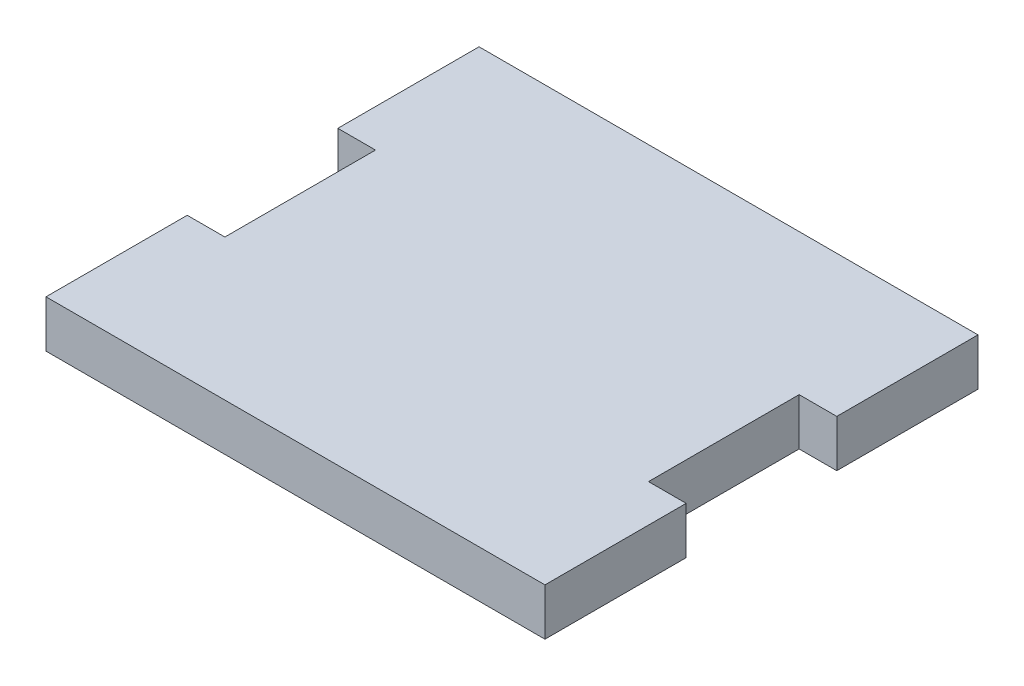
ISO-10303-21;
HEADER;
FILE_DESCRIPTION(('STEP AP214'),'2;1');
FILE_NAME('part.step','',(''),(''),'','','');
FILE_SCHEMA(('AUTOMOTIVE_DESIGN { 1 0 10303 214 1 1 1 1 }'));
ENDSEC;
DATA;
#1=APPLICATION_CONTEXT('core data for automotive mechanical design processes');
#2=APPLICATION_PROTOCOL_DEFINITION('international standard','automotive_design',2000,#1);
#3=PRODUCT_CONTEXT('',#1,'mechanical');
#4=PRODUCT('Part','Part','',(#3));
#5=PRODUCT_RELATED_PRODUCT_CATEGORY('part','',(#4));
#6=PRODUCT_DEFINITION_FORMATION('','',#4);
#7=PRODUCT_DEFINITION_CONTEXT('part definition',#1,'design');
#8=PRODUCT_DEFINITION('design','',#6,#7);
#9=PRODUCT_DEFINITION_SHAPE('','',#8);
#10=(LENGTH_UNIT() NAMED_UNIT(*) SI_UNIT(.MILLI.,.METRE.));
#11=(NAMED_UNIT(*) PLANE_ANGLE_UNIT() SI_UNIT($,.RADIAN.));
#12=(NAMED_UNIT(*) SI_UNIT($,.STERADIAN.) SOLID_ANGLE_UNIT());
#13=UNCERTAINTY_MEASURE_WITH_UNIT(LENGTH_MEASURE(1.E-05),#10,'distance_accuracy_value','');
#14=(GEOMETRIC_REPRESENTATION_CONTEXT(3) GLOBAL_UNCERTAINTY_ASSIGNED_CONTEXT((#13)) GLOBAL_UNIT_ASSIGNED_CONTEXT((#10,
#11,#12)) REPRESENTATION_CONTEXT('',''));
#15=CARTESIAN_POINT('',(0.,0.,0.));
#16=DIRECTION('',(0.,0.,1.));
#17=DIRECTION('',(1.,0.,0.));
#18=AXIS2_PLACEMENT_3D('',#15,#16,#17);
#19=CARTESIAN_POINT('',(0.,5.,8.));
#20=DIRECTION('',(0.,0.,-1.));
#21=DIRECTION('',(-1.,0.,0.));
#22=AXIS2_PLACEMENT_3D('',#19,#20,#21);
#23=PLANE('',#22);
#24=DIRECTION('',(1.,0.,0.));
#25=VECTOR('',#24,1.);
#26=CARTESIAN_POINT('',(0.,0.,8.));
#27=LINE('',#26,#25);
#28=CARTESIAN_POINT('',(22.5,0.,8.));
#29=VERTEX_POINT('',#28);
#30=CARTESIAN_POINT('',(26.5,0.,8.));
#31=VERTEX_POINT('',#30);
#32=EDGE_CURVE('E220',#29,#31,#27,.T.);
#33=ORIENTED_EDGE('',*,*,#32,.F.);
#34=DIRECTION('',(0.,-1.,0.));
#35=VECTOR('',#34,1.);
#36=CARTESIAN_POINT('',(22.5,5.,8.));
#37=LINE('',#36,#35);
#38=CARTESIAN_POINT('',(22.5,5.,8.));
#39=VERTEX_POINT('',#38);
#40=EDGE_CURVE('E11',#39,#29,#37,.T.);
#41=ORIENTED_EDGE('',*,*,#40,.F.);
#42=DIRECTION('',(1.,0.,0.));
#43=VECTOR('',#42,1.);
#44=CARTESIAN_POINT('',(0.,5.,8.));
#45=LINE('',#44,#43);
#46=CARTESIAN_POINT('',(26.5,5.,8.));
#47=VERTEX_POINT('',#46);
#48=EDGE_CURVE('E190',#39,#47,#45,.T.);
#49=ORIENTED_EDGE('',*,*,#48,.T.);
#50=DIRECTION('',(0.,-1.,0.));
#51=VECTOR('',#50,1.);
#52=CARTESIAN_POINT('',(26.5,5.,8.));
#53=LINE('',#52,#51);
#54=EDGE_CURVE('E108',#47,#31,#53,.T.);
#55=ORIENTED_EDGE('',*,*,#54,.T.);
#56=EDGE_LOOP('',(#33,#41,#49,#55));
#57=FACE_BOUND('',#56,.T.);
#58=ADVANCED_FACE('F45',(#57),#23,.T.);
#59=CARTESIAN_POINT('',(22.5,5.,0.));
#60=DIRECTION('',(1.,0.,0.));
#61=DIRECTION('',(0.,0.,-1.));
#62=AXIS2_PLACEMENT_3D('',#59,#60,#61);
#63=PLANE('',#62);
#64=DIRECTION('',(0.,0.,1.));
#65=VECTOR('',#64,1.);
#66=CARTESIAN_POINT('',(22.5,0.,0.));
#67=LINE('',#66,#65);
#68=CARTESIAN_POINT('',(22.5,0.,-8.));
#69=VERTEX_POINT('',#68);
#70=EDGE_CURVE('E215',#69,#29,#67,.T.);
#71=ORIENTED_EDGE('',*,*,#70,.F.);
#72=DIRECTION('',(0.,-1.,0.));
#73=VECTOR('',#72,1.);
#74=CARTESIAN_POINT('',(22.5,5.,-8.));
#75=LINE('',#74,#73);
#76=CARTESIAN_POINT('',(22.5,5.,-8.));
#77=VERTEX_POINT('',#76);
#78=EDGE_CURVE('E54',#77,#69,#75,.T.);
#79=ORIENTED_EDGE('',*,*,#78,.F.);
#80=DIRECTION('',(0.,0.,1.));
#81=VECTOR('',#80,1.);
#82=CARTESIAN_POINT('',(22.5,5.,0.));
#83=LINE('',#82,#81);
#84=EDGE_CURVE('E186',#77,#39,#83,.T.);
#85=ORIENTED_EDGE('',*,*,#84,.T.);
#86=ORIENTED_EDGE('',*,*,#40,.T.);
#87=EDGE_LOOP('',(#71,#79,#85,#86));
#88=FACE_BOUND('',#87,.T.);
#89=ADVANCED_FACE('F269',(#88),#63,.T.);
#90=CARTESIAN_POINT('',(0.,5.,-8.));
#91=DIRECTION('',(0.,0.,1.));
#92=DIRECTION('',(1.,0.,0.));
#93=AXIS2_PLACEMENT_3D('',#90,#91,#92);
#94=PLANE('',#93);
#95=DIRECTION('',(-1.,0.,0.));
#96=VECTOR('',#95,1.);
#97=CARTESIAN_POINT('',(0.,0.,-8.));
#98=LINE('',#97,#96);
#99=CARTESIAN_POINT('',(26.5,0.,-8.));
#100=VERTEX_POINT('',#99);
#101=EDGE_CURVE('E206',#100,#69,#98,.T.);
#102=ORIENTED_EDGE('',*,*,#101,.F.);
#103=DIRECTION('',(0.,-1.,0.));
#104=VECTOR('',#103,1.);
#105=CARTESIAN_POINT('',(26.5,5.,-8.));
#106=LINE('',#105,#104);
#107=CARTESIAN_POINT('',(26.5,5.,-8.));
#108=VERTEX_POINT('',#107);
#109=EDGE_CURVE('E260',#108,#100,#106,.T.);
#110=ORIENTED_EDGE('',*,*,#109,.F.);
#111=DIRECTION('',(-1.,0.,0.));
#112=VECTOR('',#111,1.);
#113=CARTESIAN_POINT('',(0.,5.,-8.));
#114=LINE('',#113,#112);
#115=EDGE_CURVE('E180',#108,#77,#114,.T.);
#116=ORIENTED_EDGE('',*,*,#115,.T.);
#117=ORIENTED_EDGE('',*,*,#78,.T.);
#118=EDGE_LOOP('',(#102,#110,#116,#117));
#119=FACE_BOUND('',#118,.T.);
#120=ADVANCED_FACE('F265',(#119),#94,.T.);
#121=CARTESIAN_POINT('',(26.5,5.,0.));
#122=DIRECTION('',(-1.,0.,0.));
#123=DIRECTION('',(0.,0.,1.));
#124=AXIS2_PLACEMENT_3D('',#121,#122,#123);
#125=PLANE('',#124);
#126=DIRECTION('',(0.,0.,-1.));
#127=VECTOR('',#126,1.);
#128=CARTESIAN_POINT('',(26.5,0.,0.));
#129=LINE('',#128,#127);
#130=CARTESIAN_POINT('',(26.5,0.,-23.));
#131=VERTEX_POINT('',#130);
#132=EDGE_CURVE('E195',#100,#131,#129,.T.);
#133=ORIENTED_EDGE('',*,*,#132,.T.);
#134=DIRECTION('',(0.,-1.,0.));
#135=VECTOR('',#134,1.);
#136=CARTESIAN_POINT('',(26.5,5.,-23.));
#137=LINE('',#136,#135);
#138=CARTESIAN_POINT('',(26.5,5.,-23.));
#139=VERTEX_POINT('',#138);
#140=EDGE_CURVE('E257',#139,#131,#137,.T.);
#141=ORIENTED_EDGE('',*,*,#140,.F.);
#142=DIRECTION('',(0.,0.,-1.));
#143=VECTOR('',#142,1.);
#144=CARTESIAN_POINT('',(26.5,5.,0.));
#145=LINE('',#144,#143);
#146=EDGE_CURVE('E176',#108,#139,#145,.T.);
#147=ORIENTED_EDGE('',*,*,#146,.F.);
#148=ORIENTED_EDGE('',*,*,#109,.T.);
#149=EDGE_LOOP('',(#133,#141,#147,#148));
#150=FACE_BOUND('',#149,.T.);
#151=ADVANCED_FACE('F278',(#150),#125,.F.);
#152=CARTESIAN_POINT('',(0.,5.,-23.));
#153=DIRECTION('',(0.,0.,-1.));
#154=DIRECTION('',(-1.,0.,0.));
#155=AXIS2_PLACEMENT_3D('',#152,#153,#154);
#156=PLANE('',#155);
#157=DIRECTION('',(1.,0.,0.));
#158=VECTOR('',#157,1.);
#159=CARTESIAN_POINT('',(0.,0.,-23.));
#160=LINE('',#159,#158);
#161=CARTESIAN_POINT('',(-26.5,0.,-23.));
#162=VERTEX_POINT('',#161);
#163=EDGE_CURVE('E205',#162,#131,#160,.T.);
#164=ORIENTED_EDGE('',*,*,#163,.F.);
#165=DIRECTION('',(0.,-1.,0.));
#166=VECTOR('',#165,1.);
#167=CARTESIAN_POINT('',(-26.5,5.,-23.));
#168=LINE('',#167,#166);
#169=CARTESIAN_POINT('',(-26.5,5.,-23.));
#170=VERTEX_POINT('',#169);
#171=EDGE_CURVE('E254',#170,#162,#168,.T.);
#172=ORIENTED_EDGE('',*,*,#171,.F.);
#173=DIRECTION('',(1.,0.,0.));
#174=VECTOR('',#173,1.);
#175=CARTESIAN_POINT('',(0.,5.,-23.));
#176=LINE('',#175,#174);
#177=EDGE_CURVE('E170',#170,#139,#176,.T.);
#178=ORIENTED_EDGE('',*,*,#177,.T.);
#179=ORIENTED_EDGE('',*,*,#140,.T.);
#180=EDGE_LOOP('',(#164,#172,#178,#179));
#181=FACE_BOUND('',#180,.T.);
#182=ADVANCED_FACE('F281',(#181),#156,.T.);
#183=CARTESIAN_POINT('',(-26.5,5.,0.));
#184=DIRECTION('',(-1.,0.,0.));
#185=DIRECTION('',(0.,0.,1.));
#186=AXIS2_PLACEMENT_3D('',#183,#184,#185);
#187=PLANE('',#186);
#188=DIRECTION('',(0.,0.,-1.));
#189=VECTOR('',#188,1.);
#190=CARTESIAN_POINT('',(-26.5,0.,0.));
#191=LINE('',#190,#189);
#192=CARTESIAN_POINT('',(-26.5,0.,-8.));
#193=VERTEX_POINT('',#192);
#194=EDGE_CURVE('E213',#193,#162,#191,.T.);
#195=ORIENTED_EDGE('',*,*,#194,.F.);
#196=DIRECTION('',(0.,-1.,0.));
#197=VECTOR('',#196,1.);
#198=CARTESIAN_POINT('',(-26.5,5.,-8.));
#199=LINE('',#198,#197);
#200=CARTESIAN_POINT('',(-26.5,5.,-8.));
#201=VERTEX_POINT('',#200);
#202=EDGE_CURVE('E251',#201,#193,#199,.T.);
#203=ORIENTED_EDGE('',*,*,#202,.F.);
#204=DIRECTION('',(0.,0.,-1.));
#205=VECTOR('',#204,1.);
#206=CARTESIAN_POINT('',(-26.5,5.,0.));
#207=LINE('',#206,#205);
#208=EDGE_CURVE('E161',#201,#170,#207,.T.);
#209=ORIENTED_EDGE('',*,*,#208,.T.);
#210=ORIENTED_EDGE('',*,*,#171,.T.);
#211=EDGE_LOOP('',(#195,#203,#209,#210));
#212=FACE_BOUND('',#211,.T.);
#213=ADVANCED_FACE('F284',(#212),#187,.T.);
#214=CARTESIAN_POINT('',(0.,5.,-8.));
#215=DIRECTION('',(0.,0.,-1.));
#216=DIRECTION('',(-1.,0.,0.));
#217=AXIS2_PLACEMENT_3D('',#214,#215,#216);
#218=PLANE('',#217);
#219=DIRECTION('',(1.,0.,0.));
#220=VECTOR('',#219,1.);
#221=CARTESIAN_POINT('',(0.,0.,-8.));
#222=LINE('',#221,#220);
#223=CARTESIAN_POINT('',(-22.5,0.,-8.));
#224=VERTEX_POINT('',#223);
#225=EDGE_CURVE('E432',#193,#224,#222,.T.);
#226=ORIENTED_EDGE('',*,*,#225,.T.);
#227=DIRECTION('',(0.,-1.,0.));
#228=VECTOR('',#227,1.);
#229=CARTESIAN_POINT('',(-22.5,5.,-8.));
#230=LINE('',#229,#228);
#231=CARTESIAN_POINT('',(-22.5,5.,-8.));
#232=VERTEX_POINT('',#231);
#233=EDGE_CURVE('E241',#232,#224,#230,.T.);
#234=ORIENTED_EDGE('',*,*,#233,.F.);
#235=DIRECTION('',(1.,0.,0.));
#236=VECTOR('',#235,1.);
#237=CARTESIAN_POINT('',(0.,5.,-8.));
#238=LINE('',#237,#236);
#239=EDGE_CURVE('E169',#201,#232,#238,.T.);
#240=ORIENTED_EDGE('',*,*,#239,.F.);
#241=ORIENTED_EDGE('',*,*,#202,.T.);
#242=EDGE_LOOP('',(#226,#234,#240,#241));
#243=FACE_BOUND('',#242,.T.);
#244=ADVANCED_FACE('F285',(#243),#218,.F.);
#245=CARTESIAN_POINT('',(-22.5,5.,0.));
#246=DIRECTION('',(1.,0.,0.));
#247=DIRECTION('',(0.,0.,-1.));
#248=AXIS2_PLACEMENT_3D('',#245,#246,#247);
#249=PLANE('',#248);
#250=DIRECTION('',(0.,0.,1.));
#251=VECTOR('',#250,1.);
#252=CARTESIAN_POINT('',(-22.5,0.,0.));
#253=LINE('',#252,#251);
#254=CARTESIAN_POINT('',(-22.5,0.,8.));
#255=VERTEX_POINT('',#254);
#256=EDGE_CURVE('E236',#224,#255,#253,.T.);
#257=ORIENTED_EDGE('',*,*,#256,.T.);
#258=DIRECTION('',(0.,-1.,0.));
#259=VECTOR('',#258,1.);
#260=CARTESIAN_POINT('',(-22.5,5.,8.));
#261=LINE('',#260,#259);
#262=CARTESIAN_POINT('',(-22.5,5.,8.));
#263=VERTEX_POINT('',#262);
#264=EDGE_CURVE('E233',#263,#255,#261,.T.);
#265=ORIENTED_EDGE('',*,*,#264,.F.);
#266=DIRECTION('',(0.,0.,1.));
#267=VECTOR('',#266,1.);
#268=CARTESIAN_POINT('',(-22.5,5.,0.));
#269=LINE('',#268,#267);
#270=EDGE_CURVE('E163',#232,#263,#269,.T.);
#271=ORIENTED_EDGE('',*,*,#270,.F.);
#272=ORIENTED_EDGE('',*,*,#233,.T.);
#273=EDGE_LOOP('',(#257,#265,#271,#272));
#274=FACE_BOUND('',#273,.T.);
#275=ADVANCED_FACE('F234',(#274),#249,.F.);
#276=CARTESIAN_POINT('',(0.,5.,8.));
#277=DIRECTION('',(0.,0.,1.));
#278=DIRECTION('',(1.,0.,0.));
#279=AXIS2_PLACEMENT_3D('',#276,#277,#278);
#280=PLANE('',#279);
#281=DIRECTION('',(-1.,0.,0.));
#282=VECTOR('',#281,1.);
#283=CARTESIAN_POINT('',(0.,0.,8.));
#284=LINE('',#283,#282);
#285=CARTESIAN_POINT('',(-26.5,0.,8.));
#286=VERTEX_POINT('',#285);
#287=EDGE_CURVE('E244',#255,#286,#284,.T.);
#288=ORIENTED_EDGE('',*,*,#287,.T.);
#289=DIRECTION('',(0.,-1.,0.));
#290=VECTOR('',#289,1.);
#291=CARTESIAN_POINT('',(-26.5,5.,8.));
#292=LINE('',#291,#290);
#293=CARTESIAN_POINT('',(-26.5,5.,8.));
#294=VERTEX_POINT('',#293);
#295=EDGE_CURVE('E148',#294,#286,#292,.T.);
#296=ORIENTED_EDGE('',*,*,#295,.F.);
#297=DIRECTION('',(-1.,0.,0.));
#298=VECTOR('',#297,1.);
#299=CARTESIAN_POINT('',(0.,5.,8.));
#300=LINE('',#299,#298);
#301=EDGE_CURVE('E157',#263,#294,#300,.T.);
#302=ORIENTED_EDGE('',*,*,#301,.F.);
#303=ORIENTED_EDGE('',*,*,#264,.T.);
#304=EDGE_LOOP('',(#288,#296,#302,#303));
#305=FACE_BOUND('',#304,.T.);
#306=ADVANCED_FACE('F243',(#305),#280,.F.);
#307=CARTESIAN_POINT('',(-26.5,0.,23.));
#308=VERTEX_POINT('',#307);
#309=EDGE_CURVE('E146',#308,#286,#191,.T.);
#310=ORIENTED_EDGE('',*,*,#309,.F.);
#311=DIRECTION('',(0.,-1.,0.));
#312=VECTOR('',#311,1.);
#313=CARTESIAN_POINT('',(-26.5,5.,23.));
#314=LINE('',#313,#312);
#315=CARTESIAN_POINT('',(-26.5,5.,23.));
#316=VERTEX_POINT('',#315);
#317=EDGE_CURVE('E140',#316,#308,#314,.T.);
#318=ORIENTED_EDGE('',*,*,#317,.F.);
#319=EDGE_CURVE('E144',#316,#294,#207,.T.);
#320=ORIENTED_EDGE('',*,*,#319,.T.);
#321=ORIENTED_EDGE('',*,*,#295,.T.);
#322=EDGE_LOOP('',(#310,#318,#320,#321));
#323=FACE_BOUND('',#322,.T.);
#324=ADVANCED_FACE('F142',(#323),#187,.T.);
#325=CARTESIAN_POINT('',(0.,5.,23.));
#326=DIRECTION('',(0.,0.,-1.));
#327=DIRECTION('',(-1.,0.,0.));
#328=AXIS2_PLACEMENT_3D('',#325,#326,#327);
#329=PLANE('',#328);
#330=DIRECTION('',(1.,0.,0.));
#331=VECTOR('',#330,1.);
#332=CARTESIAN_POINT('',(0.,0.,23.));
#333=LINE('',#332,#331);
#334=CARTESIAN_POINT('',(26.5,0.,23.));
#335=VERTEX_POINT('',#334);
#336=EDGE_CURVE('E101',#308,#335,#333,.T.);
#337=ORIENTED_EDGE('',*,*,#336,.T.);
#338=DIRECTION('',(0.,-1.,0.));
#339=VECTOR('',#338,1.);
#340=CARTESIAN_POINT('',(26.5,5.,23.));
#341=LINE('',#340,#339);
#342=CARTESIAN_POINT('',(26.5,5.,23.));
#343=VERTEX_POINT('',#342);
#344=EDGE_CURVE('E149',#343,#335,#341,.T.);
#345=ORIENTED_EDGE('',*,*,#344,.F.);
#346=DIRECTION('',(1.,0.,0.));
#347=VECTOR('',#346,1.);
#348=CARTESIAN_POINT('',(0.,5.,23.));
#349=LINE('',#348,#347);
#350=EDGE_CURVE('E151',#316,#343,#349,.T.);
#351=ORIENTED_EDGE('',*,*,#350,.F.);
#352=ORIENTED_EDGE('',*,*,#317,.T.);
#353=EDGE_LOOP('',(#337,#345,#351,#352));
#354=FACE_BOUND('',#353,.T.);
#355=ADVANCED_FACE('F152',(#354),#329,.F.);
#356=EDGE_CURVE('E192',#335,#31,#129,.T.);
#357=ORIENTED_EDGE('',*,*,#356,.T.);
#358=ORIENTED_EDGE('',*,*,#54,.F.);
#359=EDGE_CURVE('E62',#343,#47,#145,.T.);
#360=ORIENTED_EDGE('',*,*,#359,.F.);
#361=ORIENTED_EDGE('',*,*,#344,.T.);
#362=EDGE_LOOP('',(#357,#358,#360,#361));
#363=FACE_BOUND('',#362,.T.);
#364=ADVANCED_FACE('F297',(#363),#125,.F.);
#365=CARTESIAN_POINT('',(0.,5.,0.));
#366=DIRECTION('',(0.,1.,0.));
#367=DIRECTION('',(0.,0.,1.));
#368=AXIS2_PLACEMENT_3D('',#365,#366,#367);
#369=PLANE('',#368);
#370=ORIENTED_EDGE('',*,*,#48,.F.);
#371=ORIENTED_EDGE('',*,*,#84,.F.);
#372=ORIENTED_EDGE('',*,*,#115,.F.);
#373=ORIENTED_EDGE('',*,*,#146,.T.);
#374=ORIENTED_EDGE('',*,*,#177,.F.);
#375=ORIENTED_EDGE('',*,*,#208,.F.);
#376=ORIENTED_EDGE('',*,*,#239,.T.);
#377=ORIENTED_EDGE('',*,*,#270,.T.);
#378=ORIENTED_EDGE('',*,*,#301,.T.);
#379=ORIENTED_EDGE('',*,*,#319,.F.);
#380=ORIENTED_EDGE('',*,*,#350,.T.);
#381=ORIENTED_EDGE('',*,*,#359,.T.);
#382=EDGE_LOOP('',(#370,#371,#372,#373,#374,#375,#376,#377,#378,#379,#380,#381));
#383=FACE_BOUND('',#382,.T.);
#384=ADVANCED_FACE('F155',(#383),#369,.T.);
#385=CARTESIAN_POINT('',(0.,0.,0.));
#386=DIRECTION('',(0.,1.,0.));
#387=DIRECTION('',(0.,0.,1.));
#388=AXIS2_PLACEMENT_3D('',#385,#386,#387);
#389=PLANE('',#388);
#390=ORIENTED_EDGE('',*,*,#32,.T.);
#391=ORIENTED_EDGE('',*,*,#356,.F.);
#392=ORIENTED_EDGE('',*,*,#336,.F.);
#393=ORIENTED_EDGE('',*,*,#309,.T.);
#394=ORIENTED_EDGE('',*,*,#287,.F.);
#395=ORIENTED_EDGE('',*,*,#256,.F.);
#396=ORIENTED_EDGE('',*,*,#225,.F.);
#397=ORIENTED_EDGE('',*,*,#194,.T.);
#398=ORIENTED_EDGE('',*,*,#163,.T.);
#399=ORIENTED_EDGE('',*,*,#132,.F.);
#400=ORIENTED_EDGE('',*,*,#101,.T.);
#401=ORIENTED_EDGE('',*,*,#70,.T.);
#402=EDGE_LOOP('',(#390,#391,#392,#393,#394,#395,#396,#397,#398,#399,#400,#401));
#403=FACE_BOUND('',#402,.T.);
#404=ADVANCED_FACE('F270',(#403),#389,.F.);
#405=CLOSED_SHELL('',(#58,#89,#120,#151,#182,#213,#244,#275,#306,#324,#355,#364,#384,#404));
#406=MANIFOLD_SOLID_BREP('B2',#405);
#407=ADVANCED_BREP_SHAPE_REPRESENTATION('',(#18,#406),#14);
#408=SHAPE_DEFINITION_REPRESENTATION(#9,#407);
ENDSEC;
END-ISO-10303-21;
